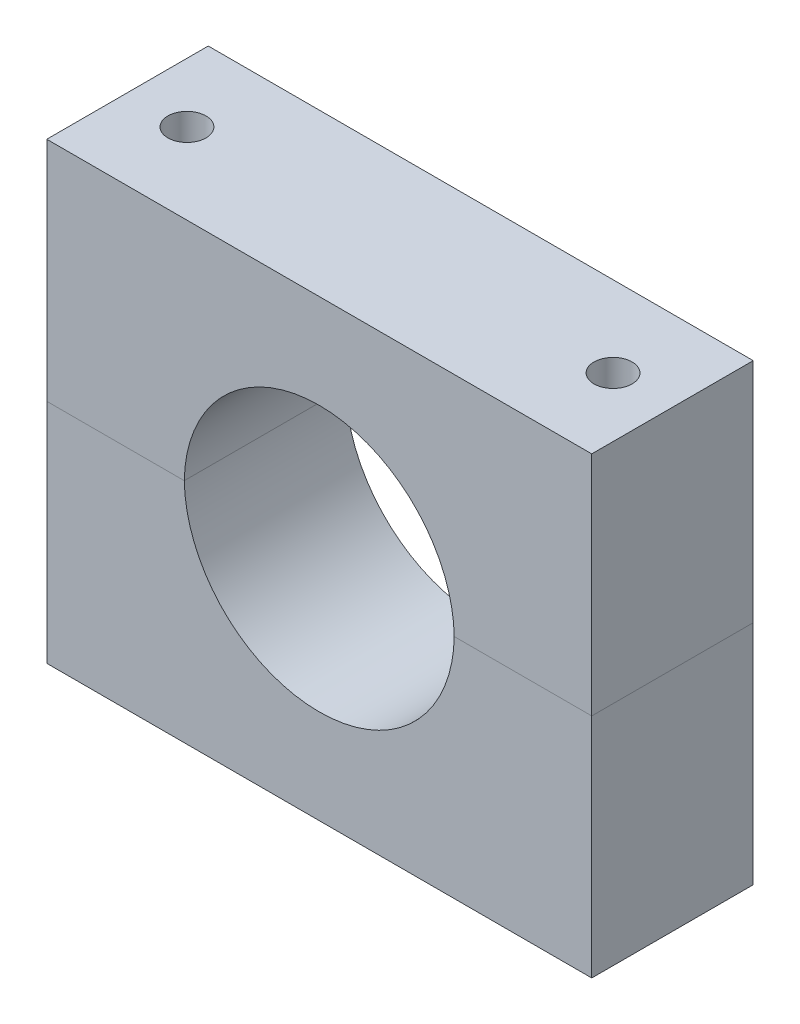
ISO-10303-21;
HEADER;
FILE_DESCRIPTION(('STEP AP214'),'2;1');
FILE_NAME('part.step','',(''),(''),'','','');
FILE_SCHEMA(('AUTOMOTIVE_DESIGN { 1 0 10303 214 1 1 1 1 }'));
ENDSEC;
DATA;
#1=APPLICATION_CONTEXT('core data for automotive mechanical design processes');
#2=APPLICATION_PROTOCOL_DEFINITION('international standard','automotive_design',2000,#1);
#3=PRODUCT_CONTEXT('',#1,'mechanical');
#4=PRODUCT('Part','Part','',(#3));
#5=PRODUCT_RELATED_PRODUCT_CATEGORY('part','',(#4));
#6=PRODUCT_DEFINITION_FORMATION('','',#4);
#7=PRODUCT_DEFINITION_CONTEXT('part definition',#1,'design');
#8=PRODUCT_DEFINITION('design','',#6,#7);
#9=PRODUCT_DEFINITION_SHAPE('','',#8);
#10=(LENGTH_UNIT() NAMED_UNIT(*) SI_UNIT(.MILLI.,.METRE.));
#11=(NAMED_UNIT(*) PLANE_ANGLE_UNIT() SI_UNIT($,.RADIAN.));
#12=(NAMED_UNIT(*) SI_UNIT($,.STERADIAN.) SOLID_ANGLE_UNIT());
#13=UNCERTAINTY_MEASURE_WITH_UNIT(LENGTH_MEASURE(1.E-05),#10,'distance_accuracy_value','');
#14=(GEOMETRIC_REPRESENTATION_CONTEXT(3) GLOBAL_UNCERTAINTY_ASSIGNED_CONTEXT((#13)) GLOBAL_UNIT_ASSIGNED_CONTEXT((#10,
#11,#12)) REPRESENTATION_CONTEXT('',''));
#15=CARTESIAN_POINT('',(0.,0.,0.));
#16=DIRECTION('',(0.,0.,1.));
#17=DIRECTION('',(1.,0.,0.));
#18=AXIS2_PLACEMENT_3D('',#15,#16,#17);
#19=CARTESIAN_POINT('',(-55.0546875,12.9747596153846,36.));
#20=DIRECTION('',(1.,0.,0.));
#21=DIRECTION('',(0.,-1.,0.));
#22=AXIS2_PLACEMENT_3D('',#19,#20,#21);
#23=PLANE('',#22);
#24=DIRECTION('',(0.,1.,0.));
#25=VECTOR('',#24,1.);
#26=CARTESIAN_POINT('',(-55.0546875,12.9747596153846,0.));
#27=LINE('',#26,#25);
#28=CARTESIAN_POINT('',(-55.0546875,-44.1126201923077,0.));
#29=VERTEX_POINT('',#28);
#30=CARTESIAN_POINT('',(-55.0546875,6.48737980769229,0.));
#31=VERTEX_POINT('',#30);
#32=EDGE_CURVE('E169',#29,#31,#27,.T.);
#33=ORIENTED_EDGE('',*,*,#32,.F.);
#34=DIRECTION('',(0.,0.,-1.));
#35=VECTOR('',#34,1.);
#36=CARTESIAN_POINT('',(-55.0546875,-44.1126201923077,36.));
#37=LINE('',#36,#35);
#38=CARTESIAN_POINT('',(-55.0546875,-44.1126201923077,36.));
#39=VERTEX_POINT('',#38);
#40=EDGE_CURVE('E179',#39,#29,#37,.T.);
#41=ORIENTED_EDGE('',*,*,#40,.F.);
#42=DIRECTION('',(0.,1.,0.));
#43=VECTOR('',#42,1.);
#44=CARTESIAN_POINT('',(-55.0546875,12.9747596153846,36.));
#45=LINE('',#44,#43);
#46=CARTESIAN_POINT('',(-55.0546875,6.4873798076923,36.));
#47=VERTEX_POINT('',#46);
#48=EDGE_CURVE('E170',#39,#47,#45,.T.);
#49=ORIENTED_EDGE('',*,*,#48,.T.);
#50=DIRECTION('',(0.,0.,-1.));
#51=VECTOR('',#50,1.);
#52=CARTESIAN_POINT('',(-55.0546875,6.48737980769229,0.));
#53=LINE('',#52,#51);
#54=EDGE_CURVE('E150',#47,#31,#53,.T.);
#55=ORIENTED_EDGE('',*,*,#54,.T.);
#56=EDGE_LOOP('',(#33,#41,#49,#55));
#57=FACE_BOUND('',#56,.T.);
#58=ADVANCED_FACE('F71',(#57),#23,.F.);
#59=CARTESIAN_POINT('',(5.69531250000002,6.98737980769229,36.));
#60=DIRECTION('',(0.,0.,-1.));
#61=DIRECTION('',(-1.,0.,0.));
#62=AXIS2_PLACEMENT_3D('',#59,#60,#61);
#63=CYLINDRICAL_SURFACE('',#62,30.1);
#64=DIRECTION('',(0.,0.,-1.));
#65=VECTOR('',#64,1.);
#66=CARTESIAN_POINT('',(35.7911593895627,6.4873798076923,36.));
#67=LINE('',#66,#65);
#68=CARTESIAN_POINT('',(35.7911593895627,6.4873798076923,36.));
#69=VERTEX_POINT('',#68);
#70=CARTESIAN_POINT('',(35.7911593895627,6.48737980769229,0.));
#71=VERTEX_POINT('',#70);
#72=EDGE_CURVE('E127',#69,#71,#67,.T.);
#73=ORIENTED_EDGE('',*,*,#72,.T.);
#74=CARTESIAN_POINT('',(5.69531250000002,6.98737980769229,0.));
#75=DIRECTION('',(0.,0.,-1.));
#76=DIRECTION('',(1.,0.,0.));
#77=AXIS2_PLACEMENT_3D('',#74,#75,#76);
#78=CIRCLE('',#77,30.1);
#79=CARTESIAN_POINT('',(-24.4005343895627,6.48737980769229,0.));
#80=VERTEX_POINT('',#79);
#81=EDGE_CURVE('E183',#71,#80,#78,.T.);
#82=ORIENTED_EDGE('',*,*,#81,.T.);
#83=DIRECTION('',(0.,0.,-1.));
#84=VECTOR('',#83,1.);
#85=CARTESIAN_POINT('',(-24.4005343895627,6.4873798076923,36.));
#86=LINE('',#85,#84);
#87=CARTESIAN_POINT('',(-24.4005343895627,6.4873798076923,36.));
#88=VERTEX_POINT('',#87);
#89=EDGE_CURVE('E162',#80,#88,#86,.F.);
#90=ORIENTED_EDGE('',*,*,#89,.T.);
#91=CARTESIAN_POINT('',(5.69531250000002,6.98737980769229,36.));
#92=DIRECTION('',(0.,0.,-1.));
#93=DIRECTION('',(1.,0.,0.));
#94=AXIS2_PLACEMENT_3D('',#91,#92,#93);
#95=CIRCLE('',#94,30.1);
#96=EDGE_CURVE('E143',#69,#88,#95,.T.);
#97=ORIENTED_EDGE('',*,*,#96,.F.);
#98=EDGE_LOOP('',(#73,#82,#90,#97));
#99=FACE_BOUND('',#98,.T.);
#100=ADVANCED_FACE('F202',(#99),#63,.F.);
#101=CARTESIAN_POINT('',(66.4453125,12.9747596153846,36.));
#102=DIRECTION('',(1.,0.,0.));
#103=DIRECTION('',(0.,0.,-1.));
#104=AXIS2_PLACEMENT_3D('',#101,#102,#103);
#105=PLANE('',#104);
#106=DIRECTION('',(0.,0.,-1.));
#107=VECTOR('',#106,1.);
#108=CARTESIAN_POINT('',(66.4453125,6.48737980769229,0.));
#109=LINE('',#108,#107);
#110=CARTESIAN_POINT('',(66.4453125,6.4873798076923,36.));
#111=VERTEX_POINT('',#110);
#112=CARTESIAN_POINT('',(66.4453125,6.48737980769229,0.));
#113=VERTEX_POINT('',#112);
#114=EDGE_CURVE('E125',#111,#113,#109,.T.);
#115=ORIENTED_EDGE('',*,*,#114,.F.);
#116=DIRECTION('',(0.,1.,0.));
#117=VECTOR('',#116,1.);
#118=CARTESIAN_POINT('',(66.4453125,12.9747596153846,36.));
#119=LINE('',#118,#117);
#120=CARTESIAN_POINT('',(66.4453125,-44.1126201923077,36.));
#121=VERTEX_POINT('',#120);
#122=EDGE_CURVE('E135',#121,#111,#119,.T.);
#123=ORIENTED_EDGE('',*,*,#122,.F.);
#124=DIRECTION('',(0.,0.,-1.));
#125=VECTOR('',#124,1.);
#126=CARTESIAN_POINT('',(66.4453125,-44.1126201923077,36.));
#127=LINE('',#126,#125);
#128=CARTESIAN_POINT('',(66.4453125,-44.1126201923077,0.));
#129=VERTEX_POINT('',#128);
#130=EDGE_CURVE('E79',#121,#129,#127,.T.);
#131=ORIENTED_EDGE('',*,*,#130,.T.);
#132=DIRECTION('',(0.,1.,0.));
#133=VECTOR('',#132,1.);
#134=CARTESIAN_POINT('',(66.4453125,12.9747596153846,0.));
#135=LINE('',#134,#133);
#136=EDGE_CURVE('E148',#129,#113,#135,.T.);
#137=ORIENTED_EDGE('',*,*,#136,.T.);
#138=EDGE_LOOP('',(#115,#123,#131,#137));
#139=FACE_BOUND('',#138,.T.);
#140=ADVANCED_FACE('F146',(#139),#105,.T.);
#141=CARTESIAN_POINT('',(0.,-44.1126201923077,36.));
#142=DIRECTION('',(0.,-1.,0.));
#143=DIRECTION('',(0.,0.,1.));
#144=AXIS2_PLACEMENT_3D('',#141,#142,#143);
#145=PLANE('',#144);
#146=CARTESIAN_POINT('',(-41.8046875,-44.1126201923077,18.));
#147=DIRECTION('',(0.,1.,0.));
#148=DIRECTION('',(0.,0.,1.));
#149=AXIS2_PLACEMENT_3D('',#146,#147,#148);
#150=CIRCLE('',#149,4.25);
#151=CARTESIAN_POINT('',(-41.8046875,-44.1126201923077,22.25));
#152=VERTEX_POINT('',#151);
#153=EDGE_CURVE('E238',#152,#152,#150,.T.);
#154=ORIENTED_EDGE('',*,*,#153,.T.);
#155=EDGE_LOOP('',(#154));
#156=FACE_BOUND('',#155,.T.);
#157=CARTESIAN_POINT('',(53.1953125,-44.1126201923077,18.));
#158=DIRECTION('',(0.,1.,0.));
#159=DIRECTION('',(0.,0.,1.));
#160=AXIS2_PLACEMENT_3D('',#157,#158,#159);
#161=CIRCLE('',#160,4.25000000000001);
#162=CARTESIAN_POINT('',(53.1953125,-44.1126201923077,22.25));
#163=VERTEX_POINT('',#162);
#164=EDGE_CURVE('E240',#163,#163,#161,.T.);
#165=ORIENTED_EDGE('',*,*,#164,.T.);
#166=EDGE_LOOP('',(#165));
#167=FACE_BOUND('',#166,.T.);
#168=DIRECTION('',(1.,0.,0.));
#169=VECTOR('',#168,1.);
#170=CARTESIAN_POINT('',(0.,-44.1126201923077,0.));
#171=LINE('',#170,#169);
#172=EDGE_CURVE('E174',#29,#129,#171,.T.);
#173=ORIENTED_EDGE('',*,*,#172,.T.);
#174=ORIENTED_EDGE('',*,*,#130,.F.);
#175=DIRECTION('',(1.,0.,0.));
#176=VECTOR('',#175,1.);
#177=CARTESIAN_POINT('',(0.,-44.1126201923077,36.));
#178=LINE('',#177,#176);
#179=EDGE_CURVE('E138',#39,#121,#178,.T.);
#180=ORIENTED_EDGE('',*,*,#179,.F.);
#181=ORIENTED_EDGE('',*,*,#40,.T.);
#182=EDGE_LOOP('',(#173,#174,#180,#181));
#183=FACE_BOUND('',#182,.T.);
#184=ADVANCED_FACE('F196',(#156,#167,#183),#145,.T.);
#185=CARTESIAN_POINT('',(0.,12.9747596153846,36.));
#186=DIRECTION('',(0.,0.,1.));
#187=DIRECTION('',(1.,0.,0.));
#188=AXIS2_PLACEMENT_3D('',#185,#186,#187);
#189=PLANE('',#188);
#190=DIRECTION('',(-1.,0.,0.));
#191=VECTOR('',#190,1.);
#192=CARTESIAN_POINT('',(66.4453125,6.4873798076923,36.));
#193=LINE('',#192,#191);
#194=EDGE_CURVE('E121',#111,#69,#193,.T.);
#195=ORIENTED_EDGE('',*,*,#194,.T.);
#196=ORIENTED_EDGE('',*,*,#96,.T.);
#197=EDGE_CURVE('E132',#88,#47,#193,.T.);
#198=ORIENTED_EDGE('',*,*,#197,.T.);
#199=ORIENTED_EDGE('',*,*,#48,.F.);
#200=ORIENTED_EDGE('',*,*,#179,.T.);
#201=ORIENTED_EDGE('',*,*,#122,.T.);
#202=EDGE_LOOP('',(#195,#196,#198,#199,#200,#201));
#203=FACE_BOUND('',#202,.T.);
#204=ADVANCED_FACE('F136',(#203),#189,.T.);
#205=CARTESIAN_POINT('',(0.,12.9747596153846,0.));
#206=DIRECTION('',(0.,0.,1.));
#207=DIRECTION('',(1.,0.,0.));
#208=AXIS2_PLACEMENT_3D('',#205,#206,#207);
#209=PLANE('',#208);
#210=ORIENTED_EDGE('',*,*,#136,.F.);
#211=ORIENTED_EDGE('',*,*,#172,.F.);
#212=ORIENTED_EDGE('',*,*,#32,.T.);
#213=DIRECTION('',(-1.,0.,0.));
#214=VECTOR('',#213,1.);
#215=CARTESIAN_POINT('',(0.,6.48737980769229,0.));
#216=LINE('',#215,#214);
#217=EDGE_CURVE('E14',#80,#31,#216,.T.);
#218=ORIENTED_EDGE('',*,*,#217,.F.);
#219=ORIENTED_EDGE('',*,*,#81,.F.);
#220=DIRECTION('',(-1.,0.,0.));
#221=VECTOR('',#220,1.);
#222=CARTESIAN_POINT('',(66.4453125,6.48737980769229,0.));
#223=LINE('',#222,#221);
#224=EDGE_CURVE('E86',#113,#71,#223,.T.);
#225=ORIENTED_EDGE('',*,*,#224,.F.);
#226=EDGE_LOOP('',(#210,#211,#212,#218,#219,#225));
#227=FACE_BOUND('',#226,.T.);
#228=ADVANCED_FACE('F200',(#227),#209,.F.);
#229=CARTESIAN_POINT('',(66.4453125,6.48737980769229,0.));
#230=DIRECTION('',(0.,-1.,0.));
#231=DIRECTION('',(0.,0.,1.));
#232=AXIS2_PLACEMENT_3D('',#229,#230,#231);
#233=PLANE('',#232);
#234=CARTESIAN_POINT('',(-41.8046875,6.48737980769229,18.));
#235=DIRECTION('',(0.,1.,0.));
#236=DIRECTION('',(0.,0.,1.));
#237=AXIS2_PLACEMENT_3D('',#234,#235,#236);
#238=CIRCLE('',#237,4.25);
#239=CARTESIAN_POINT('',(-41.8046875,6.48737980769229,22.25));
#240=VERTEX_POINT('',#239);
#241=EDGE_CURVE('E155',#240,#240,#238,.T.);
#242=ORIENTED_EDGE('',*,*,#241,.F.);
#243=EDGE_LOOP('',(#242));
#244=FACE_BOUND('',#243,.T.);
#245=ORIENTED_EDGE('',*,*,#89,.F.);
#246=ORIENTED_EDGE('',*,*,#217,.T.);
#247=ORIENTED_EDGE('',*,*,#54,.F.);
#248=ORIENTED_EDGE('',*,*,#197,.F.);
#249=EDGE_LOOP('',(#245,#246,#247,#248));
#250=FACE_BOUND('',#249,.T.);
#251=ADVANCED_FACE('F203',(#244,#250),#233,.F.);
#252=CARTESIAN_POINT('',(53.1953125,6.48737980769229,18.));
#253=DIRECTION('',(0.,1.,0.));
#254=DIRECTION('',(0.,0.,1.));
#255=AXIS2_PLACEMENT_3D('',#252,#253,#254);
#256=CIRCLE('',#255,4.25000000000001);
#257=CARTESIAN_POINT('',(53.1953125,6.48737980769229,22.25));
#258=VERTEX_POINT('',#257);
#259=EDGE_CURVE('E158',#258,#258,#256,.T.);
#260=ORIENTED_EDGE('',*,*,#259,.F.);
#261=EDGE_LOOP('',(#260));
#262=FACE_BOUND('',#261,.T.);
#263=ORIENTED_EDGE('',*,*,#72,.F.);
#264=ORIENTED_EDGE('',*,*,#194,.F.);
#265=ORIENTED_EDGE('',*,*,#114,.T.);
#266=ORIENTED_EDGE('',*,*,#224,.T.);
#267=EDGE_LOOP('',(#263,#264,#265,#266));
#268=FACE_BOUND('',#267,.T.);
#269=ADVANCED_FACE('F123',(#262,#268),#233,.F.);
#270=CARTESIAN_POINT('',(53.1953125,6.48737980769229,18.));
#271=DIRECTION('',(0.,-1.,0.));
#272=DIRECTION('',(0.,0.,1.));
#273=AXIS2_PLACEMENT_3D('',#270,#271,#272);
#274=CYLINDRICAL_SURFACE('',#273,4.25000000000001);
#275=ORIENTED_EDGE('',*,*,#259,.T.);
#276=EDGE_LOOP('',(#275));
#277=FACE_BOUND('',#276,.T.);
#278=ORIENTED_EDGE('',*,*,#164,.F.);
#279=EDGE_LOOP('',(#278));
#280=FACE_BOUND('',#279,.T.);
#281=ADVANCED_FACE('F224',(#277,#280),#274,.F.);
#282=CARTESIAN_POINT('',(-41.8046875,6.48737980769229,18.));
#283=DIRECTION('',(0.,-1.,0.));
#284=DIRECTION('',(0.,0.,1.));
#285=AXIS2_PLACEMENT_3D('',#282,#283,#284);
#286=CYLINDRICAL_SURFACE('',#285,4.25);
#287=ORIENTED_EDGE('',*,*,#241,.T.);
#288=EDGE_LOOP('',(#287));
#289=FACE_BOUND('',#288,.T.);
#290=ORIENTED_EDGE('',*,*,#153,.F.);
#291=EDGE_LOOP('',(#290));
#292=FACE_BOUND('',#291,.T.);
#293=ADVANCED_FACE('F227',(#289,#292),#286,.F.);
#294=CLOSED_SHELL('',(#58,#100,#140,#184,#204,#228,#251,#269,#281,#293));
#295=MANIFOLD_SOLID_BREP('B2',#294);
#296=CARTESIAN_POINT('',(-55.0546875,0.,36.));
#297=DIRECTION('',(1.,0.,0.));
#298=DIRECTION('',(0.,1.,0.));
#299=AXIS2_PLACEMENT_3D('',#296,#297,#298);
#300=PLANE('',#299);
#301=DIRECTION('',(0.,-1.,0.));
#302=VECTOR('',#301,1.);
#303=CARTESIAN_POINT('',(-55.0546875,0.,0.));
#304=LINE('',#303,#302);
#305=CARTESIAN_POINT('',(-55.0546875,57.0873798076923,0.));
#306=VERTEX_POINT('',#305);
#307=CARTESIAN_POINT('',(-55.0546875,6.4873798076923,0.));
#308=VERTEX_POINT('',#307);
#309=EDGE_CURVE('E430',#306,#308,#304,.T.);
#310=ORIENTED_EDGE('',*,*,#309,.T.);
#311=DIRECTION('',(0.,0.,-1.));
#312=VECTOR('',#311,1.);
#313=CARTESIAN_POINT('',(-55.0546875,6.48737980769229,0.));
#314=LINE('',#313,#312);
#315=CARTESIAN_POINT('',(-55.0546875,6.4873798076923,36.));
#316=VERTEX_POINT('',#315);
#317=EDGE_CURVE('E366',#316,#308,#314,.T.);
#318=ORIENTED_EDGE('',*,*,#317,.F.);
#319=DIRECTION('',(0.,-1.,0.));
#320=VECTOR('',#319,1.);
#321=CARTESIAN_POINT('',(-55.0546875,0.,36.));
#322=LINE('',#321,#320);
#323=CARTESIAN_POINT('',(-55.0546875,57.0873798076923,36.));
#324=VERTEX_POINT('',#323);
#325=EDGE_CURVE('E426',#324,#316,#322,.T.);
#326=ORIENTED_EDGE('',*,*,#325,.F.);
#327=DIRECTION('',(0.,0.,-1.));
#328=VECTOR('',#327,1.);
#329=CARTESIAN_POINT('',(-55.0546875,57.0873798076923,36.));
#330=LINE('',#329,#328);
#331=EDGE_CURVE('E424',#324,#306,#330,.T.);
#332=ORIENTED_EDGE('',*,*,#331,.T.);
#333=EDGE_LOOP('',(#310,#318,#326,#332));
#334=FACE_BOUND('',#333,.T.);
#335=ADVANCED_FACE('F343',(#334),#300,.F.);
#336=CARTESIAN_POINT('',(5.69531250000002,5.9873798076923,36.));
#337=DIRECTION('',(0.,0.,-1.));
#338=DIRECTION('',(-1.,0.,0.));
#339=AXIS2_PLACEMENT_3D('',#336,#337,#338);
#340=CYLINDRICAL_SURFACE('',#339,30.1);
#341=DIRECTION('',(0.,0.,-1.));
#342=VECTOR('',#341,1.);
#343=CARTESIAN_POINT('',(35.7911593895627,6.4873798076923,36.));
#344=LINE('',#343,#342);
#345=CARTESIAN_POINT('',(35.7911593895627,6.4873798076923,36.));
#346=VERTEX_POINT('',#345);
#347=CARTESIAN_POINT('',(35.7911593895627,6.48737980769229,0.));
#348=VERTEX_POINT('',#347);
#349=EDGE_CURVE('E358',#346,#348,#344,.T.);
#350=ORIENTED_EDGE('',*,*,#349,.F.);
#351=CARTESIAN_POINT('',(5.69531250000002,5.9873798076923,36.));
#352=DIRECTION('',(0.,0.,1.));
#353=DIRECTION('',(1.,0.,0.));
#354=AXIS2_PLACEMENT_3D('',#351,#352,#353);
#355=CIRCLE('',#354,30.1);
#356=CARTESIAN_POINT('',(-24.4005343895627,6.4873798076923,36.));
#357=VERTEX_POINT('',#356);
#358=EDGE_CURVE('E414',#346,#357,#355,.T.);
#359=ORIENTED_EDGE('',*,*,#358,.T.);
#360=DIRECTION('',(0.,0.,-1.));
#361=VECTOR('',#360,1.);
#362=CARTESIAN_POINT('',(-24.4005343895627,6.4873798076923,36.));
#363=LINE('',#362,#361);
#364=CARTESIAN_POINT('',(-24.4005343895627,6.48737980769229,0.));
#365=VERTEX_POINT('',#364);
#366=EDGE_CURVE('E462',#365,#357,#363,.F.);
#367=ORIENTED_EDGE('',*,*,#366,.F.);
#368=CARTESIAN_POINT('',(5.69531250000002,5.9873798076923,0.));
#369=DIRECTION('',(0.,0.,1.));
#370=DIRECTION('',(1.,0.,0.));
#371=AXIS2_PLACEMENT_3D('',#368,#369,#370);
#372=CIRCLE('',#371,30.1);
#373=EDGE_CURVE('E434',#348,#365,#372,.T.);
#374=ORIENTED_EDGE('',*,*,#373,.F.);
#375=EDGE_LOOP('',(#350,#359,#367,#374));
#376=FACE_BOUND('',#375,.T.);
#377=ADVANCED_FACE('F511',(#376),#340,.F.);
#378=CARTESIAN_POINT('',(66.4453125,0.,36.));
#379=DIRECTION('',(1.,0.,0.));
#380=DIRECTION('',(0.,0.,-1.));
#381=AXIS2_PLACEMENT_3D('',#378,#379,#380);
#382=PLANE('',#381);
#383=DIRECTION('',(0.,0.,-1.));
#384=VECTOR('',#383,1.);
#385=CARTESIAN_POINT('',(66.4453125,6.48737980769229,0.));
#386=LINE('',#385,#384);
#387=CARTESIAN_POINT('',(66.4453125,6.4873798076923,36.));
#388=VERTEX_POINT('',#387);
#389=CARTESIAN_POINT('',(66.4453125,6.48737980769229,0.));
#390=VERTEX_POINT('',#389);
#391=EDGE_CURVE('E393',#388,#390,#386,.T.);
#392=ORIENTED_EDGE('',*,*,#391,.T.);
#393=DIRECTION('',(0.,-1.,0.));
#394=VECTOR('',#393,1.);
#395=CARTESIAN_POINT('',(66.4453125,0.,0.));
#396=LINE('',#395,#394);
#397=CARTESIAN_POINT('',(66.4453125,57.0873798076923,0.));
#398=VERTEX_POINT('',#397);
#399=EDGE_CURVE('E438',#398,#390,#396,.T.);
#400=ORIENTED_EDGE('',*,*,#399,.F.);
#401=DIRECTION('',(0.,0.,-1.));
#402=VECTOR('',#401,1.);
#403=CARTESIAN_POINT('',(66.4453125,57.0873798076923,36.));
#404=LINE('',#403,#402);
#405=CARTESIAN_POINT('',(66.4453125,57.0873798076923,36.));
#406=VERTEX_POINT('',#405);
#407=EDGE_CURVE('E351',#406,#398,#404,.T.);
#408=ORIENTED_EDGE('',*,*,#407,.F.);
#409=DIRECTION('',(0.,-1.,0.));
#410=VECTOR('',#409,1.);
#411=CARTESIAN_POINT('',(66.4453125,0.,36.));
#412=LINE('',#411,#410);
#413=EDGE_CURVE('E410',#406,#388,#412,.T.);
#414=ORIENTED_EDGE('',*,*,#413,.T.);
#415=EDGE_LOOP('',(#392,#400,#408,#414));
#416=FACE_BOUND('',#415,.T.);
#417=ADVANCED_FACE('F417',(#416),#382,.T.);
#418=CARTESIAN_POINT('',(0.,57.0873798076923,36.));
#419=DIRECTION('',(0.,1.,0.));
#420=DIRECTION('',(0.,0.,1.));
#421=AXIS2_PLACEMENT_3D('',#418,#419,#420);
#422=PLANE('',#421);
#423=CARTESIAN_POINT('',(-41.8046875,57.0873798076923,18.));
#424=DIRECTION('',(0.,1.,0.));
#425=DIRECTION('',(0.,0.,1.));
#426=AXIS2_PLACEMENT_3D('',#423,#424,#425);
#427=CIRCLE('',#426,4.25);
#428=CARTESIAN_POINT('',(-41.8046875,57.0873798076923,22.25));
#429=VERTEX_POINT('',#428);
#430=EDGE_CURVE('E478',#429,#429,#427,.T.);
#431=ORIENTED_EDGE('',*,*,#430,.F.);
#432=EDGE_LOOP('',(#431));
#433=FACE_BOUND('',#432,.T.);
#434=CARTESIAN_POINT('',(53.1953125,57.0873798076923,18.));
#435=DIRECTION('',(0.,1.,0.));
#436=DIRECTION('',(0.,0.,1.));
#437=AXIS2_PLACEMENT_3D('',#434,#435,#436);
#438=CIRCLE('',#437,4.25000000000001);
#439=CARTESIAN_POINT('',(53.1953125,57.0873798076923,22.25));
#440=VERTEX_POINT('',#439);
#441=EDGE_CURVE('E474',#440,#440,#438,.T.);
#442=ORIENTED_EDGE('',*,*,#441,.F.);
#443=EDGE_LOOP('',(#442));
#444=FACE_BOUND('',#443,.T.);
#445=DIRECTION('',(1.,0.,0.));
#446=VECTOR('',#445,1.);
#447=CARTESIAN_POINT('',(0.,57.0873798076923,0.));
#448=LINE('',#447,#446);
#449=EDGE_CURVE('E441',#306,#398,#448,.T.);
#450=ORIENTED_EDGE('',*,*,#449,.F.);
#451=ORIENTED_EDGE('',*,*,#331,.F.);
#452=DIRECTION('',(1.,0.,0.));
#453=VECTOR('',#452,1.);
#454=CARTESIAN_POINT('',(0.,57.0873798076923,36.));
#455=LINE('',#454,#453);
#456=EDGE_CURVE('E419',#324,#406,#455,.T.);
#457=ORIENTED_EDGE('',*,*,#456,.T.);
#458=ORIENTED_EDGE('',*,*,#407,.T.);
#459=EDGE_LOOP('',(#450,#451,#457,#458));
#460=FACE_BOUND('',#459,.T.);
#461=ADVANCED_FACE('F450',(#433,#444,#460),#422,.T.);
#462=CARTESIAN_POINT('',(0.,0.,36.));
#463=DIRECTION('',(0.,0.,1.));
#464=DIRECTION('',(1.,0.,0.));
#465=AXIS2_PLACEMENT_3D('',#462,#463,#464);
#466=PLANE('',#465);
#467=DIRECTION('',(-1.,0.,0.));
#468=VECTOR('',#467,1.);
#469=CARTESIAN_POINT('',(66.4453125,6.4873798076923,36.));
#470=LINE('',#469,#468);
#471=EDGE_CURVE('E396',#388,#346,#470,.T.);
#472=ORIENTED_EDGE('',*,*,#471,.F.);
#473=ORIENTED_EDGE('',*,*,#413,.F.);
#474=ORIENTED_EDGE('',*,*,#456,.F.);
#475=ORIENTED_EDGE('',*,*,#325,.T.);
#476=EDGE_CURVE('E403',#357,#316,#470,.T.);
#477=ORIENTED_EDGE('',*,*,#476,.F.);
#478=ORIENTED_EDGE('',*,*,#358,.F.);
#479=EDGE_LOOP('',(#472,#473,#474,#475,#477,#478));
#480=FACE_BOUND('',#479,.T.);
#481=ADVANCED_FACE('F408',(#480),#466,.T.);
#482=CARTESIAN_POINT('',(0.,0.,0.));
#483=DIRECTION('',(0.,0.,1.));
#484=DIRECTION('',(1.,0.,0.));
#485=AXIS2_PLACEMENT_3D('',#482,#483,#484);
#486=PLANE('',#485);
#487=ORIENTED_EDGE('',*,*,#399,.T.);
#488=DIRECTION('',(-1.,0.,0.));
#489=VECTOR('',#488,1.);
#490=CARTESIAN_POINT('',(66.4453125,6.48737980769229,0.));
#491=LINE('',#490,#489);
#492=EDGE_CURVE('E397',#390,#348,#491,.T.);
#493=ORIENTED_EDGE('',*,*,#492,.T.);
#494=ORIENTED_EDGE('',*,*,#373,.T.);
#495=DIRECTION('',(-1.,0.,0.));
#496=VECTOR('',#495,1.);
#497=CARTESIAN_POINT('',(0.,6.48737980769229,0.));
#498=LINE('',#497,#496);
#499=EDGE_CURVE('E69',#365,#308,#498,.T.);
#500=ORIENTED_EDGE('',*,*,#499,.T.);
#501=ORIENTED_EDGE('',*,*,#309,.F.);
#502=ORIENTED_EDGE('',*,*,#449,.T.);
#503=EDGE_LOOP('',(#487,#493,#494,#500,#501,#502));
#504=FACE_BOUND('',#503,.T.);
#505=ADVANCED_FACE('F453',(#504),#486,.F.);
#506=CARTESIAN_POINT('',(66.4453125,6.48737980769229,0.));
#507=DIRECTION('',(0.,1.,0.));
#508=DIRECTION('',(0.,0.,1.));
#509=AXIS2_PLACEMENT_3D('',#506,#507,#508);
#510=PLANE('',#509);
#511=CARTESIAN_POINT('',(-41.8046875,6.4873798076923,18.));
#512=DIRECTION('',(0.,1.,0.));
#513=DIRECTION('',(0.,0.,1.));
#514=AXIS2_PLACEMENT_3D('',#511,#512,#513);
#515=CIRCLE('',#514,4.25);
#516=CARTESIAN_POINT('',(-41.8046875,6.4873798076923,22.25));
#517=VERTEX_POINT('',#516);
#518=EDGE_CURVE('E468',#517,#517,#515,.T.);
#519=ORIENTED_EDGE('',*,*,#518,.T.);
#520=EDGE_LOOP('',(#519));
#521=FACE_BOUND('',#520,.T.);
#522=ORIENTED_EDGE('',*,*,#366,.T.);
#523=ORIENTED_EDGE('',*,*,#476,.T.);
#524=ORIENTED_EDGE('',*,*,#317,.T.);
#525=ORIENTED_EDGE('',*,*,#499,.F.);
#526=EDGE_LOOP('',(#522,#523,#524,#525));
#527=FACE_BOUND('',#526,.T.);
#528=ADVANCED_FACE('F487',(#521,#527),#510,.F.);
#529=CARTESIAN_POINT('',(53.1953125,6.4873798076923,18.));
#530=DIRECTION('',(0.,1.,0.));
#531=DIRECTION('',(0.,0.,1.));
#532=AXIS2_PLACEMENT_3D('',#529,#530,#531);
#533=CIRCLE('',#532,4.25000000000001);
#534=CARTESIAN_POINT('',(53.1953125,6.4873798076923,22.25));
#535=VERTEX_POINT('',#534);
#536=EDGE_CURVE('E470',#535,#535,#533,.T.);
#537=ORIENTED_EDGE('',*,*,#536,.T.);
#538=EDGE_LOOP('',(#537));
#539=FACE_BOUND('',#538,.T.);
#540=ORIENTED_EDGE('',*,*,#349,.T.);
#541=ORIENTED_EDGE('',*,*,#492,.F.);
#542=ORIENTED_EDGE('',*,*,#391,.F.);
#543=ORIENTED_EDGE('',*,*,#471,.T.);
#544=EDGE_LOOP('',(#540,#541,#542,#543));
#545=FACE_BOUND('',#544,.T.);
#546=ADVANCED_FACE('F395',(#539,#545),#510,.F.);
#547=CARTESIAN_POINT('',(53.1953125,6.4873798076923,18.));
#548=DIRECTION('',(0.,1.,0.));
#549=DIRECTION('',(0.,0.,1.));
#550=AXIS2_PLACEMENT_3D('',#547,#548,#549);
#551=CYLINDRICAL_SURFACE('',#550,4.25000000000001);
#552=ORIENTED_EDGE('',*,*,#536,.F.);
#553=EDGE_LOOP('',(#552));
#554=FACE_BOUND('',#553,.T.);
#555=ORIENTED_EDGE('',*,*,#441,.T.);
#556=EDGE_LOOP('',(#555));
#557=FACE_BOUND('',#556,.T.);
#558=ADVANCED_FACE('F492',(#554,#557),#551,.F.);
#559=CARTESIAN_POINT('',(-41.8046875,6.4873798076923,18.));
#560=DIRECTION('',(0.,1.,0.));
#561=DIRECTION('',(0.,0.,1.));
#562=AXIS2_PLACEMENT_3D('',#559,#560,#561);
#563=CYLINDRICAL_SURFACE('',#562,4.25);
#564=ORIENTED_EDGE('',*,*,#518,.F.);
#565=EDGE_LOOP('',(#564));
#566=FACE_BOUND('',#565,.T.);
#567=ORIENTED_EDGE('',*,*,#430,.T.);
#568=EDGE_LOOP('',(#567));
#569=FACE_BOUND('',#568,.T.);
#570=ADVANCED_FACE('F489',(#566,#569),#563,.F.);
#571=CLOSED_SHELL('',(#335,#377,#417,#461,#481,#505,#528,#546,#558,#570));
#572=MANIFOLD_SOLID_BREP('B8',#571);
#573=ADVANCED_BREP_SHAPE_REPRESENTATION('',(#18,#295,#572),#14);
#574=SHAPE_DEFINITION_REPRESENTATION(#9,#573);
ENDSEC;
END-ISO-10303-21;
